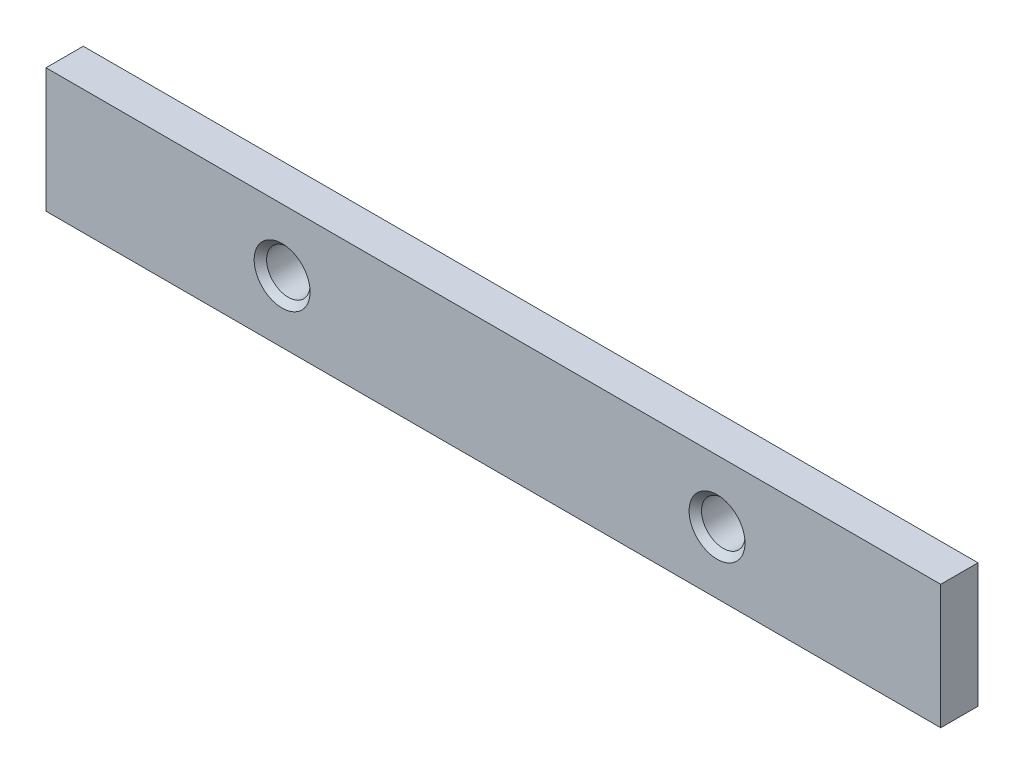
ISO-10303-21;
HEADER;
FILE_DESCRIPTION(('STEP AP214'),'2;1');
FILE_NAME('part.step','',(''),(''),'','','');
FILE_SCHEMA(('AUTOMOTIVE_DESIGN { 1 0 10303 214 1 1 1 1 }'));
ENDSEC;
DATA;
#1=APPLICATION_CONTEXT('core data for automotive mechanical design processes');
#2=APPLICATION_PROTOCOL_DEFINITION('international standard','automotive_design',2000,#1);
#3=PRODUCT_CONTEXT('',#1,'mechanical');
#4=PRODUCT('Part','Part','',(#3));
#5=PRODUCT_RELATED_PRODUCT_CATEGORY('part','',(#4));
#6=PRODUCT_DEFINITION_FORMATION('','',#4);
#7=PRODUCT_DEFINITION_CONTEXT('part definition',#1,'design');
#8=PRODUCT_DEFINITION('design','',#6,#7);
#9=PRODUCT_DEFINITION_SHAPE('','',#8);
#10=(LENGTH_UNIT() NAMED_UNIT(*) SI_UNIT(.MILLI.,.METRE.));
#11=(NAMED_UNIT(*) PLANE_ANGLE_UNIT() SI_UNIT($,.RADIAN.));
#12=(NAMED_UNIT(*) SI_UNIT($,.STERADIAN.) SOLID_ANGLE_UNIT());
#13=UNCERTAINTY_MEASURE_WITH_UNIT(LENGTH_MEASURE(1.E-05),#10,'distance_accuracy_value','');
#14=(GEOMETRIC_REPRESENTATION_CONTEXT(3) GLOBAL_UNCERTAINTY_ASSIGNED_CONTEXT((#13)) GLOBAL_UNIT_ASSIGNED_CONTEXT((#10,
#11,#12)) REPRESENTATION_CONTEXT('',''));
#15=CARTESIAN_POINT('',(0.,0.,0.));
#16=DIRECTION('',(0.,0.,1.));
#17=DIRECTION('',(1.,0.,0.));
#18=AXIS2_PLACEMENT_3D('',#15,#16,#17);
#19=CARTESIAN_POINT('',(72.,10.,6.));
#20=DIRECTION('',(-1.,0.,0.));
#21=DIRECTION('',(0.,0.,1.));
#22=AXIS2_PLACEMENT_3D('',#19,#20,#21);
#23=PLANE('',#22);
#24=DIRECTION('',(0.,1.,0.));
#25=VECTOR('',#24,1.);
#26=CARTESIAN_POINT('',(72.,10.,0.));
#27=LINE('',#26,#25);
#28=CARTESIAN_POINT('',(72.,-10.,0.));
#29=VERTEX_POINT('',#28);
#30=CARTESIAN_POINT('',(72.,10.,0.));
#31=VERTEX_POINT('',#30);
#32=EDGE_CURVE('E96',#29,#31,#27,.T.);
#33=ORIENTED_EDGE('',*,*,#32,.T.);
#34=DIRECTION('',(0.,0.,-1.));
#35=VECTOR('',#34,1.);
#36=CARTESIAN_POINT('',(72.,10.,6.));
#37=LINE('',#36,#35);
#38=CARTESIAN_POINT('',(72.,10.,6.));
#39=VERTEX_POINT('',#38);
#40=EDGE_CURVE('E11',#39,#31,#37,.T.);
#41=ORIENTED_EDGE('',*,*,#40,.F.);
#42=DIRECTION('',(0.,1.,0.));
#43=VECTOR('',#42,1.);
#44=CARTESIAN_POINT('',(72.,10.,6.));
#45=LINE('',#44,#43);
#46=CARTESIAN_POINT('',(72.,-10.,6.));
#47=VERTEX_POINT('',#46);
#48=EDGE_CURVE('E84',#47,#39,#45,.T.);
#49=ORIENTED_EDGE('',*,*,#48,.F.);
#50=DIRECTION('',(0.,0.,-1.));
#51=VECTOR('',#50,1.);
#52=CARTESIAN_POINT('',(72.,-10.,6.));
#53=LINE('',#52,#51);
#54=EDGE_CURVE('E92',#47,#29,#53,.T.);
#55=ORIENTED_EDGE('',*,*,#54,.T.);
#56=EDGE_LOOP('',(#33,#41,#49,#55));
#57=FACE_BOUND('',#56,.T.);
#58=ADVANCED_FACE('F33',(#57),#23,.F.);
#59=CARTESIAN_POINT('',(-72.,10.,6.));
#60=DIRECTION('',(0.,-1.,0.));
#61=DIRECTION('',(0.,0.,-1.));
#62=AXIS2_PLACEMENT_3D('',#59,#60,#61);
#63=PLANE('',#62);
#64=DIRECTION('',(-1.,0.,0.));
#65=VECTOR('',#64,1.);
#66=CARTESIAN_POINT('',(-72.,10.,0.));
#67=LINE('',#66,#65);
#68=CARTESIAN_POINT('',(-72.,10.,0.));
#69=VERTEX_POINT('',#68);
#70=EDGE_CURVE('E88',#31,#69,#67,.T.);
#71=ORIENTED_EDGE('',*,*,#70,.T.);
#72=DIRECTION('',(0.,0.,-1.));
#73=VECTOR('',#72,1.);
#74=CARTESIAN_POINT('',(-72.,10.,6.));
#75=LINE('',#74,#73);
#76=CARTESIAN_POINT('',(-72.,10.,6.));
#77=VERTEX_POINT('',#76);
#78=EDGE_CURVE('E41',#77,#69,#75,.T.);
#79=ORIENTED_EDGE('',*,*,#78,.F.);
#80=DIRECTION('',(-1.,0.,0.));
#81=VECTOR('',#80,1.);
#82=CARTESIAN_POINT('',(-72.,10.,6.));
#83=LINE('',#82,#81);
#84=EDGE_CURVE('E79',#39,#77,#83,.T.);
#85=ORIENTED_EDGE('',*,*,#84,.F.);
#86=ORIENTED_EDGE('',*,*,#40,.T.);
#87=EDGE_LOOP('',(#71,#79,#85,#86));
#88=FACE_BOUND('',#87,.T.);
#89=ADVANCED_FACE('F87',(#88),#63,.F.);
#90=CARTESIAN_POINT('',(-72.,10.,6.));
#91=DIRECTION('',(1.,0.,0.));
#92=DIRECTION('',(0.,0.,-1.));
#93=AXIS2_PLACEMENT_3D('',#90,#91,#92);
#94=PLANE('',#93);
#95=DIRECTION('',(0.,-1.,0.));
#96=VECTOR('',#95,1.);
#97=CARTESIAN_POINT('',(-72.,10.,0.));
#98=LINE('',#97,#96);
#99=CARTESIAN_POINT('',(-72.,-10.,0.));
#100=VERTEX_POINT('',#99);
#101=EDGE_CURVE('E66',#69,#100,#98,.T.);
#102=ORIENTED_EDGE('',*,*,#101,.T.);
#103=DIRECTION('',(0.,0.,-1.));
#104=VECTOR('',#103,1.);
#105=CARTESIAN_POINT('',(-72.,-10.,6.));
#106=LINE('',#105,#104);
#107=CARTESIAN_POINT('',(-72.,-10.,6.));
#108=VERTEX_POINT('',#107);
#109=EDGE_CURVE('E89',#108,#100,#106,.T.);
#110=ORIENTED_EDGE('',*,*,#109,.F.);
#111=DIRECTION('',(0.,-1.,0.));
#112=VECTOR('',#111,1.);
#113=CARTESIAN_POINT('',(-72.,10.,6.));
#114=LINE('',#113,#112);
#115=EDGE_CURVE('E82',#77,#108,#114,.T.);
#116=ORIENTED_EDGE('',*,*,#115,.F.);
#117=ORIENTED_EDGE('',*,*,#78,.T.);
#118=EDGE_LOOP('',(#102,#110,#116,#117));
#119=FACE_BOUND('',#118,.T.);
#120=ADVANCED_FACE('F90',(#119),#94,.F.);
#121=CARTESIAN_POINT('',(-72.,-10.,6.));
#122=DIRECTION('',(0.,1.,0.));
#123=DIRECTION('',(0.,0.,1.));
#124=AXIS2_PLACEMENT_3D('',#121,#122,#123);
#125=PLANE('',#124);
#126=DIRECTION('',(1.,0.,0.));
#127=VECTOR('',#126,1.);
#128=CARTESIAN_POINT('',(-72.,-10.,0.));
#129=LINE('',#128,#127);
#130=EDGE_CURVE('E72',#100,#29,#129,.T.);
#131=ORIENTED_EDGE('',*,*,#130,.T.);
#132=ORIENTED_EDGE('',*,*,#54,.F.);
#133=DIRECTION('',(1.,0.,0.));
#134=VECTOR('',#133,1.);
#135=CARTESIAN_POINT('',(-72.,-10.,6.));
#136=LINE('',#135,#134);
#137=EDGE_CURVE('E49',#108,#47,#136,.T.);
#138=ORIENTED_EDGE('',*,*,#137,.F.);
#139=ORIENTED_EDGE('',*,*,#109,.T.);
#140=EDGE_LOOP('',(#131,#132,#138,#139));
#141=FACE_BOUND('',#140,.T.);
#142=ADVANCED_FACE('F104',(#141),#125,.F.);
#143=CARTESIAN_POINT('',(0.,0.,6.));
#144=DIRECTION('',(0.,0.,1.));
#145=DIRECTION('',(1.,0.,0.));
#146=AXIS2_PLACEMENT_3D('',#143,#144,#145);
#147=PLANE('',#146);
#148=CARTESIAN_POINT('',(-34.,0.,6.));
#149=DIRECTION('',(0.,0.,1.));
#150=DIRECTION('',(1.,0.,0.));
#151=AXIS2_PLACEMENT_3D('',#148,#149,#150);
#152=CIRCLE('',#151,4.5);
#153=CARTESIAN_POINT('',(-29.5,0.,6.));
#154=VERTEX_POINT('',#153);
#155=EDGE_CURVE('E124',#154,#154,#152,.T.);
#156=ORIENTED_EDGE('',*,*,#155,.F.);
#157=EDGE_LOOP('',(#156));
#158=FACE_BOUND('',#157,.T.);
#159=CARTESIAN_POINT('',(36.,0.,6.));
#160=DIRECTION('',(0.,0.,1.));
#161=DIRECTION('',(1.,0.,0.));
#162=AXIS2_PLACEMENT_3D('',#159,#160,#161);
#163=CIRCLE('',#162,4.5);
#164=CARTESIAN_POINT('',(40.5,0.,6.));
#165=VERTEX_POINT('',#164);
#166=EDGE_CURVE('E115',#165,#165,#163,.T.);
#167=ORIENTED_EDGE('',*,*,#166,.F.);
#168=EDGE_LOOP('',(#167));
#169=FACE_BOUND('',#168,.T.);
#170=ORIENTED_EDGE('',*,*,#48,.T.);
#171=ORIENTED_EDGE('',*,*,#84,.T.);
#172=ORIENTED_EDGE('',*,*,#115,.T.);
#173=ORIENTED_EDGE('',*,*,#137,.T.);
#174=EDGE_LOOP('',(#170,#171,#172,#173));
#175=FACE_BOUND('',#174,.T.);
#176=ADVANCED_FACE('F80',(#158,#169,#175),#147,.T.);
#177=CARTESIAN_POINT('',(0.,0.,0.));
#178=DIRECTION('',(0.,0.,1.));
#179=DIRECTION('',(1.,0.,0.));
#180=AXIS2_PLACEMENT_3D('',#177,#178,#179);
#181=PLANE('',#180);
#182=CARTESIAN_POINT('',(-34.,0.,0.));
#183=DIRECTION('',(0.,0.,1.));
#184=DIRECTION('',(1.,0.,0.));
#185=AXIS2_PLACEMENT_3D('',#182,#183,#184);
#186=CIRCLE('',#185,3.5);
#187=CARTESIAN_POINT('',(-30.5,0.,0.));
#188=VERTEX_POINT('',#187);
#189=EDGE_CURVE('E118',#188,#188,#186,.T.);
#190=ORIENTED_EDGE('',*,*,#189,.T.);
#191=EDGE_LOOP('',(#190));
#192=FACE_BOUND('',#191,.T.);
#193=CARTESIAN_POINT('',(36.,0.,0.));
#194=DIRECTION('',(0.,0.,1.));
#195=DIRECTION('',(1.,0.,0.));
#196=AXIS2_PLACEMENT_3D('',#193,#194,#195);
#197=CIRCLE('',#196,3.5);
#198=CARTESIAN_POINT('',(39.5,0.,0.));
#199=VERTEX_POINT('',#198);
#200=EDGE_CURVE('E99',#199,#199,#197,.T.);
#201=ORIENTED_EDGE('',*,*,#200,.T.);
#202=EDGE_LOOP('',(#201));
#203=FACE_BOUND('',#202,.T.);
#204=ORIENTED_EDGE('',*,*,#32,.F.);
#205=ORIENTED_EDGE('',*,*,#130,.F.);
#206=ORIENTED_EDGE('',*,*,#101,.F.);
#207=ORIENTED_EDGE('',*,*,#70,.F.);
#208=EDGE_LOOP('',(#204,#205,#206,#207));
#209=FACE_BOUND('',#208,.T.);
#210=ADVANCED_FACE('F107',(#192,#203,#209),#181,.F.);
#211=CARTESIAN_POINT('',(36.,0.,6.));
#212=DIRECTION('',(0.,0.,1.));
#213=DIRECTION('',(1.,0.,0.));
#214=AXIS2_PLACEMENT_3D('',#211,#212,#213);
#215=CYLINDRICAL_SURFACE('',#214,3.5);
#216=ORIENTED_EDGE('',*,*,#200,.F.);
#217=EDGE_LOOP('',(#216));
#218=FACE_BOUND('',#217,.T.);
#219=CARTESIAN_POINT('',(36.,0.,5.));
#220=DIRECTION('',(0.,0.,1.));
#221=DIRECTION('',(1.,0.,0.));
#222=AXIS2_PLACEMENT_3D('',#219,#220,#221);
#223=CIRCLE('',#222,3.5);
#224=CARTESIAN_POINT('',(39.5,0.,5.));
#225=VERTEX_POINT('',#224);
#226=EDGE_CURVE('E112',#225,#225,#223,.T.);
#227=ORIENTED_EDGE('',*,*,#226,.T.);
#228=EDGE_LOOP('',(#227));
#229=FACE_BOUND('',#228,.T.);
#230=ADVANCED_FACE('F138',(#218,#229),#215,.F.);
#231=CARTESIAN_POINT('',(36.,0.,6.));
#232=DIRECTION('',(0.,0.,1.));
#233=DIRECTION('',(1.,0.,0.));
#234=AXIS2_PLACEMENT_3D('',#231,#232,#233);
#235=CONICAL_SURFACE('',#234,4.5,0.785398163397444);
#236=ORIENTED_EDGE('',*,*,#226,.F.);
#237=EDGE_LOOP('',(#236));
#238=FACE_BOUND('',#237,.T.);
#239=ORIENTED_EDGE('',*,*,#166,.T.);
#240=EDGE_LOOP('',(#239));
#241=FACE_BOUND('',#240,.T.);
#242=ADVANCED_FACE('F135',(#238,#241),#235,.F.);
#243=CARTESIAN_POINT('',(-34.,0.,6.));
#244=DIRECTION('',(0.,0.,1.));
#245=DIRECTION('',(1.,0.,0.));
#246=AXIS2_PLACEMENT_3D('',#243,#244,#245);
#247=CYLINDRICAL_SURFACE('',#246,3.5);
#248=ORIENTED_EDGE('',*,*,#189,.F.);
#249=EDGE_LOOP('',(#248));
#250=FACE_BOUND('',#249,.T.);
#251=CARTESIAN_POINT('',(-34.,0.,5.));
#252=DIRECTION('',(0.,0.,1.));
#253=DIRECTION('',(1.,0.,0.));
#254=AXIS2_PLACEMENT_3D('',#251,#252,#253);
#255=CIRCLE('',#254,3.5);
#256=CARTESIAN_POINT('',(-30.5,0.,5.));
#257=VERTEX_POINT('',#256);
#258=EDGE_CURVE('E121',#257,#257,#255,.T.);
#259=ORIENTED_EDGE('',*,*,#258,.T.);
#260=EDGE_LOOP('',(#259));
#261=FACE_BOUND('',#260,.T.);
#262=ADVANCED_FACE('F137',(#250,#261),#247,.F.);
#263=CARTESIAN_POINT('',(-34.,0.,6.));
#264=DIRECTION('',(0.,0.,1.));
#265=DIRECTION('',(1.,0.,0.));
#266=AXIS2_PLACEMENT_3D('',#263,#264,#265);
#267=CONICAL_SURFACE('',#266,4.5,0.785398163397447);
#268=ORIENTED_EDGE('',*,*,#258,.F.);
#269=EDGE_LOOP('',(#268));
#270=FACE_BOUND('',#269,.T.);
#271=ORIENTED_EDGE('',*,*,#155,.T.);
#272=EDGE_LOOP('',(#271));
#273=FACE_BOUND('',#272,.T.);
#274=ADVANCED_FACE('F128',(#270,#273),#267,.F.);
#275=CLOSED_SHELL('',(#58,#89,#120,#142,#176,#210,#230,#242,#262,#274));
#276=MANIFOLD_SOLID_BREP('B2',#275);
#277=ADVANCED_BREP_SHAPE_REPRESENTATION('',(#18,#276),#14);
#278=SHAPE_DEFINITION_REPRESENTATION(#9,#277);
ENDSEC;
END-ISO-10303-21;
